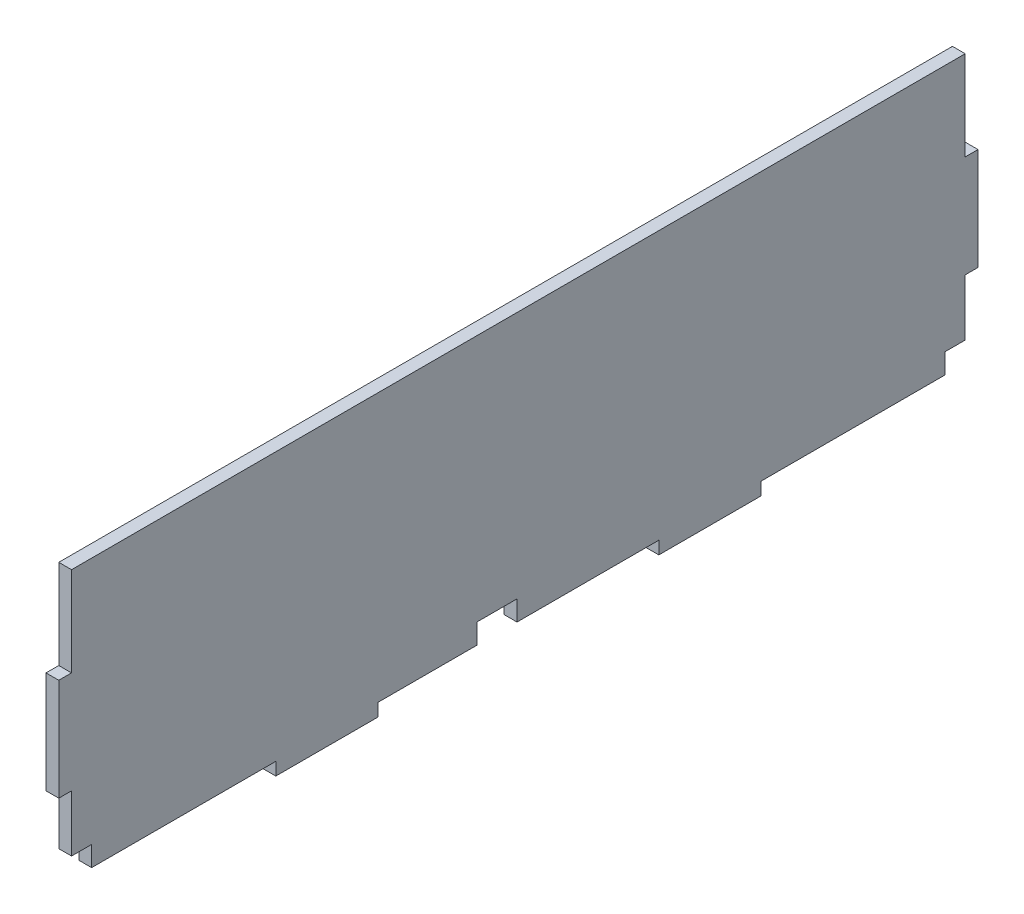
ISO-10303-21;
HEADER;
FILE_DESCRIPTION(('STEP AP214'),'2;1');
FILE_NAME('part.step','',(''),(''),'','','');
FILE_SCHEMA(('AUTOMOTIVE_DESIGN { 1 0 10303 214 1 1 1 1 }'));
ENDSEC;
DATA;
#1=APPLICATION_CONTEXT('core data for automotive mechanical design processes');
#2=APPLICATION_PROTOCOL_DEFINITION('international standard','automotive_design',2000,#1);
#3=PRODUCT_CONTEXT('',#1,'mechanical');
#4=PRODUCT('Part','Part','',(#3));
#5=PRODUCT_RELATED_PRODUCT_CATEGORY('part','',(#4));
#6=PRODUCT_DEFINITION_FORMATION('','',#4);
#7=PRODUCT_DEFINITION_CONTEXT('part definition',#1,'design');
#8=PRODUCT_DEFINITION('design','',#6,#7);
#9=PRODUCT_DEFINITION_SHAPE('','',#8);
#10=(LENGTH_UNIT() NAMED_UNIT(*) SI_UNIT(.MILLI.,.METRE.));
#11=(NAMED_UNIT(*) PLANE_ANGLE_UNIT() SI_UNIT($,.RADIAN.));
#12=(NAMED_UNIT(*) SI_UNIT($,.STERADIAN.) SOLID_ANGLE_UNIT());
#13=UNCERTAINTY_MEASURE_WITH_UNIT(LENGTH_MEASURE(1.E-05),#10,'distance_accuracy_value','');
#14=(GEOMETRIC_REPRESENTATION_CONTEXT(3) GLOBAL_UNCERTAINTY_ASSIGNED_CONTEXT((#13)) GLOBAL_UNIT_ASSIGNED_CONTEXT((#10,
#11,#12)) REPRESENTATION_CONTEXT('',''));
#15=CARTESIAN_POINT('',(0.,0.,0.));
#16=DIRECTION('',(0.,0.,1.));
#17=DIRECTION('',(1.,0.,0.));
#18=AXIS2_PLACEMENT_3D('',#15,#16,#17);
#19=CARTESIAN_POINT('',(3.175,-36.0159875393909,29.5840964815032));
#20=DIRECTION('',(0.,1.,0.));
#21=DIRECTION('',(0.,0.,1.));
#22=AXIS2_PLACEMENT_3D('',#19,#20,#21);
#23=PLANE('',#22);
#24=DIRECTION('',(0.,0.,-1.));
#25=VECTOR('',#24,1.);
#26=CARTESIAN_POINT('',(0.,-36.0159875393909,29.5840964815032));
#27=LINE('',#26,#25);
#28=CARTESIAN_POINT('',(0.,-36.0159875393909,29.5840964815032));
#29=VERTEX_POINT('',#28);
#30=CARTESIAN_POINT('',(0.,-36.0159875393909,5.));
#31=VERTEX_POINT('',#30);
#32=EDGE_CURVE('E235',#29,#31,#27,.T.);
#33=ORIENTED_EDGE('',*,*,#32,.T.);
#34=DIRECTION('',(1.,0.,0.));
#35=VECTOR('',#34,1.);
#36=CARTESIAN_POINT('',(-6.825,-36.0159875393909,5.));
#37=LINE('',#36,#35);
#38=CARTESIAN_POINT('',(3.175,-36.0159875393909,5.));
#39=VERTEX_POINT('',#38);
#40=EDGE_CURVE('E219',#31,#39,#37,.T.);
#41=ORIENTED_EDGE('',*,*,#40,.T.);
#42=DIRECTION('',(0.,0.,-1.));
#43=VECTOR('',#42,1.);
#44=CARTESIAN_POINT('',(3.175,-36.0159875393909,29.5840964815032));
#45=LINE('',#44,#43);
#46=CARTESIAN_POINT('',(3.175,-36.0159875393909,29.5840964815032));
#47=VERTEX_POINT('',#46);
#48=EDGE_CURVE('E233',#47,#39,#45,.T.);
#49=ORIENTED_EDGE('',*,*,#48,.F.);
#50=DIRECTION('',(-1.,0.,0.));
#51=VECTOR('',#50,1.);
#52=CARTESIAN_POINT('',(3.175,-36.0159875393909,29.5840964815032));
#53=LINE('',#52,#51);
#54=EDGE_CURVE('E335',#47,#29,#53,.T.);
#55=ORIENTED_EDGE('',*,*,#54,.T.);
#56=EDGE_LOOP('',(#33,#41,#49,#55));
#57=FACE_BOUND('',#56,.T.);
#58=ADVANCED_FACE('F33',(#57),#23,.F.);
#59=CARTESIAN_POINT('',(3.175,33.8340124606091,105.784096481503));
#60=DIRECTION('',(0.,0.,-1.));
#61=DIRECTION('',(0.,1.,0.));
#62=AXIS2_PLACEMENT_3D('',#59,#60,#61);
#63=PLANE('',#62);
#64=DIRECTION('',(0.,-1.,0.));
#65=VECTOR('',#64,1.);
#66=CARTESIAN_POINT('',(3.175,33.8340124606091,105.784096481503));
#67=LINE('',#66,#65);
#68=CARTESIAN_POINT('',(3.175,30.6590124606091,105.784096481503));
#69=VERTEX_POINT('',#68);
#70=CARTESIAN_POINT('',(3.175,8.43401246060913,105.784096481503));
#71=VERTEX_POINT('',#70);
#72=EDGE_CURVE('E311',#69,#71,#67,.T.);
#73=ORIENTED_EDGE('',*,*,#72,.F.);
#74=DIRECTION('',(1.,0.,0.));
#75=VECTOR('',#74,1.);
#76=CARTESIAN_POINT('',(0.,30.6590124606091,105.784096481503));
#77=LINE('',#76,#75);
#78=CARTESIAN_POINT('',(0.,30.6590124606091,105.784096481503));
#79=VERTEX_POINT('',#78);
#80=EDGE_CURVE('E413',#79,#69,#77,.T.);
#81=ORIENTED_EDGE('',*,*,#80,.F.);
#82=DIRECTION('',(0.,-1.,0.));
#83=VECTOR('',#82,1.);
#84=CARTESIAN_POINT('',(0.,33.8340124606091,105.784096481503));
#85=LINE('',#84,#83);
#86=CARTESIAN_POINT('',(0.,8.43401246060913,105.784096481503));
#87=VERTEX_POINT('',#86);
#88=EDGE_CURVE('E269',#79,#87,#85,.T.);
#89=ORIENTED_EDGE('',*,*,#88,.T.);
#90=DIRECTION('',(-1.,0.,0.));
#91=VECTOR('',#90,1.);
#92=CARTESIAN_POINT('',(3.175,8.43401246060913,105.784096481503));
#93=LINE('',#92,#91);
#94=EDGE_CURVE('E355',#71,#87,#93,.T.);
#95=ORIENTED_EDGE('',*,*,#94,.F.);
#96=EDGE_LOOP('',(#73,#81,#89,#95));
#97=FACE_BOUND('',#96,.T.);
#98=ADVANCED_FACE('F35',(#97),#63,.F.);
#99=CARTESIAN_POINT('',(3.175,8.43401246060913,105.784096481503));
#100=DIRECTION('',(0.,-1.,0.));
#101=DIRECTION('',(0.,0.,-1.));
#102=AXIS2_PLACEMENT_3D('',#99,#100,#101);
#103=PLANE('',#102);
#104=DIRECTION('',(0.,0.,1.));
#105=VECTOR('',#104,1.);
#106=CARTESIAN_POINT('',(0.,8.43401246060913,105.784096481503));
#107=LINE('',#106,#105);
#108=CARTESIAN_POINT('',(0.,8.43401246060913,108.959096481503));
#109=VERTEX_POINT('',#108);
#110=EDGE_CURVE('E271',#87,#109,#107,.T.);
#111=ORIENTED_EDGE('',*,*,#110,.T.);
#112=DIRECTION('',(-1.,0.,0.));
#113=VECTOR('',#112,1.);
#114=CARTESIAN_POINT('',(3.175,8.43401246060913,108.959096481503));
#115=LINE('',#114,#113);
#116=CARTESIAN_POINT('',(3.175,8.43401246060913,108.959096481503));
#117=VERTEX_POINT('',#116);
#118=EDGE_CURVE('E352',#117,#109,#115,.T.);
#119=ORIENTED_EDGE('',*,*,#118,.F.);
#120=DIRECTION('',(0.,0.,1.));
#121=VECTOR('',#120,1.);
#122=CARTESIAN_POINT('',(3.175,8.43401246060913,105.784096481503));
#123=LINE('',#122,#121);
#124=EDGE_CURVE('E419',#71,#117,#123,.T.);
#125=ORIENTED_EDGE('',*,*,#124,.F.);
#126=ORIENTED_EDGE('',*,*,#94,.T.);
#127=EDGE_LOOP('',(#111,#119,#125,#126));
#128=FACE_BOUND('',#127,.T.);
#129=ADVANCED_FACE('F477',(#128),#103,.F.);
#130=CARTESIAN_POINT('',(3.175,8.43401246060913,108.959096481503));
#131=DIRECTION('',(0.,0.,-1.));
#132=DIRECTION('',(-1.,0.,0.));
#133=AXIS2_PLACEMENT_3D('',#130,#131,#132);
#134=PLANE('',#133);
#135=DIRECTION('',(0.,-1.,0.));
#136=VECTOR('',#135,1.);
#137=CARTESIAN_POINT('',(0.,8.43401246060913,108.959096481503));
#138=LINE('',#137,#136);
#139=CARTESIAN_POINT('',(0.,-16.9659875393909,108.959096481503));
#140=VERTEX_POINT('',#139);
#141=EDGE_CURVE('E274',#109,#140,#138,.T.);
#142=ORIENTED_EDGE('',*,*,#141,.T.);
#143=DIRECTION('',(-1.,0.,0.));
#144=VECTOR('',#143,1.);
#145=CARTESIAN_POINT('',(3.175,-16.9659875393909,108.959096481503));
#146=LINE('',#145,#144);
#147=CARTESIAN_POINT('',(3.175,-16.9659875393909,108.959096481503));
#148=VERTEX_POINT('',#147);
#149=EDGE_CURVE('E349',#148,#140,#146,.T.);
#150=ORIENTED_EDGE('',*,*,#149,.F.);
#151=DIRECTION('',(0.,-1.,0.));
#152=VECTOR('',#151,1.);
#153=CARTESIAN_POINT('',(3.175,8.43401246060913,108.959096481503));
#154=LINE('',#153,#152);
#155=EDGE_CURVE('E421',#117,#148,#154,.T.);
#156=ORIENTED_EDGE('',*,*,#155,.F.);
#157=ORIENTED_EDGE('',*,*,#118,.T.);
#158=EDGE_LOOP('',(#142,#150,#156,#157));
#159=FACE_BOUND('',#158,.T.);
#160=ADVANCED_FACE('F473',(#159),#134,.F.);
#161=CARTESIAN_POINT('',(3.175,-16.9659875393909,108.959096481503));
#162=DIRECTION('',(0.,1.,0.));
#163=DIRECTION('',(0.,0.,1.));
#164=AXIS2_PLACEMENT_3D('',#161,#162,#163);
#165=PLANE('',#164);
#166=DIRECTION('',(0.,0.,-1.));
#167=VECTOR('',#166,1.);
#168=CARTESIAN_POINT('',(0.,-16.9659875393909,108.959096481503));
#169=LINE('',#168,#167);
#170=CARTESIAN_POINT('',(0.,-16.9659875393909,105.784096481503));
#171=VERTEX_POINT('',#170);
#172=EDGE_CURVE('E276',#140,#171,#169,.T.);
#173=ORIENTED_EDGE('',*,*,#172,.T.);
#174=DIRECTION('',(-1.,0.,0.));
#175=VECTOR('',#174,1.);
#176=CARTESIAN_POINT('',(3.175,-16.9659875393909,105.784096481503));
#177=LINE('',#176,#175);
#178=CARTESIAN_POINT('',(3.175,-16.9659875393909,105.784096481503));
#179=VERTEX_POINT('',#178);
#180=EDGE_CURVE('E346',#179,#171,#177,.T.);
#181=ORIENTED_EDGE('',*,*,#180,.F.);
#182=DIRECTION('',(0.,0.,-1.));
#183=VECTOR('',#182,1.);
#184=CARTESIAN_POINT('',(3.175,-16.9659875393909,108.959096481503));
#185=LINE('',#184,#183);
#186=EDGE_CURVE('E423',#148,#179,#185,.T.);
#187=ORIENTED_EDGE('',*,*,#186,.F.);
#188=ORIENTED_EDGE('',*,*,#149,.T.);
#189=EDGE_LOOP('',(#173,#181,#187,#188));
#190=FACE_BOUND('',#189,.T.);
#191=ADVANCED_FACE('F468',(#190),#165,.F.);
#192=CARTESIAN_POINT('',(3.175,-16.9659875393909,105.784096481503));
#193=DIRECTION('',(0.,0.,-1.));
#194=DIRECTION('',(0.,1.,0.));
#195=AXIS2_PLACEMENT_3D('',#192,#193,#194);
#196=PLANE('',#195);
#197=DIRECTION('',(0.,-1.,0.));
#198=VECTOR('',#197,1.);
#199=CARTESIAN_POINT('',(0.,-16.9659875393909,105.784096481503));
#200=LINE('',#199,#198);
#201=CARTESIAN_POINT('',(0.,-31.0159875393909,105.784096481503));
#202=VERTEX_POINT('',#201);
#203=EDGE_CURVE('E278',#171,#202,#200,.T.);
#204=ORIENTED_EDGE('',*,*,#203,.T.);
#205=DIRECTION('',(1.,0.,0.));
#206=VECTOR('',#205,1.);
#207=CARTESIAN_POINT('',(-6.825,-31.0159875393909,105.784096481503));
#208=LINE('',#207,#206);
#209=CARTESIAN_POINT('',(3.175,-31.0159875393909,105.784096481503));
#210=VERTEX_POINT('',#209);
#211=EDGE_CURVE('E403',#202,#210,#208,.T.);
#212=ORIENTED_EDGE('',*,*,#211,.T.);
#213=DIRECTION('',(0.,-1.,0.));
#214=VECTOR('',#213,1.);
#215=CARTESIAN_POINT('',(3.175,-16.9659875393909,105.784096481503));
#216=LINE('',#215,#214);
#217=EDGE_CURVE('E425',#179,#210,#216,.T.);
#218=ORIENTED_EDGE('',*,*,#217,.F.);
#219=ORIENTED_EDGE('',*,*,#180,.T.);
#220=EDGE_LOOP('',(#204,#212,#218,#219));
#221=FACE_BOUND('',#220,.T.);
#222=ADVANCED_FACE('F461',(#221),#196,.F.);
#223=CARTESIAN_POINT('',(3.175,-36.0159875393909,105.784096481503));
#224=DIRECTION('',(0.,1.,0.));
#225=DIRECTION('',(0.,0.,1.));
#226=AXIS2_PLACEMENT_3D('',#223,#224,#225);
#227=PLANE('',#226);
#228=DIRECTION('',(0.,0.,-1.));
#229=VECTOR('',#228,1.);
#230=CARTESIAN_POINT('',(3.175,-36.0159875393909,105.784096481503));
#231=LINE('',#230,#229);
#232=CARTESIAN_POINT('',(3.175,-36.0159875393909,100.784096481503));
#233=VERTEX_POINT('',#232);
#234=CARTESIAN_POINT('',(3.175,-36.0159875393909,54.9840964815032));
#235=VERTEX_POINT('',#234);
#236=EDGE_CURVE('E428',#233,#235,#231,.T.);
#237=ORIENTED_EDGE('',*,*,#236,.F.);
#238=DIRECTION('',(1.,0.,0.));
#239=VECTOR('',#238,1.);
#240=CARTESIAN_POINT('',(-6.825,-36.0159875393909,100.784096481503));
#241=LINE('',#240,#239);
#242=CARTESIAN_POINT('',(0.,-36.0159875393909,100.784096481503));
#243=VERTEX_POINT('',#242);
#244=EDGE_CURVE('E402',#243,#233,#241,.T.);
#245=ORIENTED_EDGE('',*,*,#244,.F.);
#246=DIRECTION('',(0.,0.,-1.));
#247=VECTOR('',#246,1.);
#248=CARTESIAN_POINT('',(0.,-36.0159875393909,105.784096481503));
#249=LINE('',#248,#247);
#250=CARTESIAN_POINT('',(0.,-36.0159875393909,54.9840964815032));
#251=VERTEX_POINT('',#250);
#252=EDGE_CURVE('E281',#243,#251,#249,.T.);
#253=ORIENTED_EDGE('',*,*,#252,.T.);
#254=DIRECTION('',(-1.,0.,0.));
#255=VECTOR('',#254,1.);
#256=CARTESIAN_POINT('',(3.175,-36.0159875393909,54.9840964815032));
#257=LINE('',#256,#255);
#258=EDGE_CURVE('E343',#235,#251,#257,.T.);
#259=ORIENTED_EDGE('',*,*,#258,.F.);
#260=EDGE_LOOP('',(#237,#245,#253,#259));
#261=FACE_BOUND('',#260,.T.);
#262=ADVANCED_FACE('F450',(#261),#227,.F.);
#263=CARTESIAN_POINT('',(3.175,-36.0159875393909,54.9840964815032));
#264=DIRECTION('',(0.,0.,-1.));
#265=DIRECTION('',(0.,1.,0.));
#266=AXIS2_PLACEMENT_3D('',#263,#264,#265);
#267=PLANE('',#266);
#268=DIRECTION('',(0.,-1.,0.));
#269=VECTOR('',#268,1.);
#270=CARTESIAN_POINT('',(0.,-36.0159875393909,54.9840964815032));
#271=LINE('',#270,#269);
#272=CARTESIAN_POINT('',(0.,-39.1909875393909,54.9840964815032));
#273=VERTEX_POINT('',#272);
#274=EDGE_CURVE('E283',#251,#273,#271,.T.);
#275=ORIENTED_EDGE('',*,*,#274,.T.);
#276=DIRECTION('',(-1.,0.,0.));
#277=VECTOR('',#276,1.);
#278=CARTESIAN_POINT('',(3.175,-39.1909875393909,54.9840964815032));
#279=LINE('',#278,#277);
#280=CARTESIAN_POINT('',(3.175,-39.1909875393909,54.9840964815032));
#281=VERTEX_POINT('',#280);
#282=EDGE_CURVE('E340',#281,#273,#279,.T.);
#283=ORIENTED_EDGE('',*,*,#282,.F.);
#284=DIRECTION('',(0.,-1.,0.));
#285=VECTOR('',#284,1.);
#286=CARTESIAN_POINT('',(3.175,-36.0159875393909,54.9840964815032));
#287=LINE('',#286,#285);
#288=EDGE_CURVE('E430',#235,#281,#287,.T.);
#289=ORIENTED_EDGE('',*,*,#288,.F.);
#290=ORIENTED_EDGE('',*,*,#258,.T.);
#291=EDGE_LOOP('',(#275,#283,#289,#290));
#292=FACE_BOUND('',#291,.T.);
#293=ADVANCED_FACE('F446',(#292),#267,.F.);
#294=CARTESIAN_POINT('',(3.175,-39.1909875393909,54.9840964815032));
#295=DIRECTION('',(0.,1.,0.));
#296=DIRECTION('',(0.,0.,1.));
#297=AXIS2_PLACEMENT_3D('',#294,#295,#296);
#298=PLANE('',#297);
#299=DIRECTION('',(0.,0.,-1.));
#300=VECTOR('',#299,1.);
#301=CARTESIAN_POINT('',(0.,-39.1909875393909,54.9840964815032));
#302=LINE('',#301,#300);
#303=CARTESIAN_POINT('',(0.,-39.1909875393909,29.5840964815032));
#304=VERTEX_POINT('',#303);
#305=EDGE_CURVE('E285',#273,#304,#302,.T.);
#306=ORIENTED_EDGE('',*,*,#305,.T.);
#307=DIRECTION('',(-1.,0.,0.));
#308=VECTOR('',#307,1.);
#309=CARTESIAN_POINT('',(3.175,-39.1909875393909,29.5840964815032));
#310=LINE('',#309,#308);
#311=CARTESIAN_POINT('',(3.175,-39.1909875393909,29.5840964815032));
#312=VERTEX_POINT('',#311);
#313=EDGE_CURVE('E337',#312,#304,#310,.T.);
#314=ORIENTED_EDGE('',*,*,#313,.F.);
#315=DIRECTION('',(0.,0.,-1.));
#316=VECTOR('',#315,1.);
#317=CARTESIAN_POINT('',(3.175,-39.1909875393909,54.9840964815032));
#318=LINE('',#317,#316);
#319=EDGE_CURVE('E431',#281,#312,#318,.T.);
#320=ORIENTED_EDGE('',*,*,#319,.F.);
#321=ORIENTED_EDGE('',*,*,#282,.T.);
#322=EDGE_LOOP('',(#306,#314,#320,#321));
#323=FACE_BOUND('',#322,.T.);
#324=ADVANCED_FACE('F437',(#323),#298,.F.);
#325=CARTESIAN_POINT('',(3.175,-39.1909875393909,29.5840964815032));
#326=DIRECTION('',(0.,0.,1.));
#327=DIRECTION('',(0.,-1.,0.));
#328=AXIS2_PLACEMENT_3D('',#325,#326,#327);
#329=PLANE('',#328);
#330=DIRECTION('',(0.,1.,0.));
#331=VECTOR('',#330,1.);
#332=CARTESIAN_POINT('',(0.,-39.1909875393909,29.5840964815032));
#333=LINE('',#332,#331);
#334=EDGE_CURVE('E287',#304,#29,#333,.T.);
#335=ORIENTED_EDGE('',*,*,#334,.T.);
#336=ORIENTED_EDGE('',*,*,#54,.F.);
#337=DIRECTION('',(0.,1.,0.));
#338=VECTOR('',#337,1.);
#339=CARTESIAN_POINT('',(3.175,-39.1909875393909,29.5840964815032));
#340=LINE('',#339,#338);
#341=EDGE_CURVE('E241',#312,#47,#340,.T.);
#342=ORIENTED_EDGE('',*,*,#341,.F.);
#343=ORIENTED_EDGE('',*,*,#313,.T.);
#344=EDGE_LOOP('',(#335,#336,#342,#343));
#345=FACE_BOUND('',#344,.T.);
#346=ADVANCED_FACE('F441',(#345),#329,.F.);
#347=CARTESIAN_POINT('',(3.175,-36.0159875393909,-5.));
#348=VERTEX_POINT('',#347);
#349=CARTESIAN_POINT('',(3.175,-36.0159875393908,-40.2659035184968));
#350=VERTEX_POINT('',#349);
#351=EDGE_CURVE('E244',#348,#350,#45,.T.);
#352=ORIENTED_EDGE('',*,*,#351,.F.);
#353=DIRECTION('',(1.,0.,0.));
#354=VECTOR('',#353,1.);
#355=CARTESIAN_POINT('',(-6.825,-36.0159875393909,-5.));
#356=LINE('',#355,#354);
#357=CARTESIAN_POINT('',(0.,-36.0159875393909,-5.));
#358=VERTEX_POINT('',#357);
#359=EDGE_CURVE('E236',#358,#348,#356,.T.);
#360=ORIENTED_EDGE('',*,*,#359,.F.);
#361=CARTESIAN_POINT('',(0.,-36.0159875393908,-40.2659035184968));
#362=VERTEX_POINT('',#361);
#363=EDGE_CURVE('E289',#358,#362,#27,.T.);
#364=ORIENTED_EDGE('',*,*,#363,.T.);
#365=DIRECTION('',(-1.,0.,0.));
#366=VECTOR('',#365,1.);
#367=CARTESIAN_POINT('',(3.175,-36.0159875393908,-40.2659035184968));
#368=LINE('',#367,#366);
#369=EDGE_CURVE('E332',#350,#362,#368,.T.);
#370=ORIENTED_EDGE('',*,*,#369,.F.);
#371=EDGE_LOOP('',(#352,#360,#364,#370));
#372=FACE_BOUND('',#371,.T.);
#373=ADVANCED_FACE('F381',(#372),#23,.F.);
#374=CARTESIAN_POINT('',(3.175,-36.0159875393908,-40.2659035184968));
#375=DIRECTION('',(0.,0.,-1.));
#376=DIRECTION('',(0.,1.,0.));
#377=AXIS2_PLACEMENT_3D('',#374,#375,#376);
#378=PLANE('',#377);
#379=DIRECTION('',(0.,-1.,0.));
#380=VECTOR('',#379,1.);
#381=CARTESIAN_POINT('',(0.,-36.0159875393908,-40.2659035184968));
#382=LINE('',#381,#380);
#383=CARTESIAN_POINT('',(0.,-39.1909875393909,-40.2659035184968));
#384=VERTEX_POINT('',#383);
#385=EDGE_CURVE('E291',#362,#384,#382,.T.);
#386=ORIENTED_EDGE('',*,*,#385,.T.);
#387=DIRECTION('',(-1.,0.,0.));
#388=VECTOR('',#387,1.);
#389=CARTESIAN_POINT('',(3.175,-39.1909875393909,-40.2659035184968));
#390=LINE('',#389,#388);
#391=CARTESIAN_POINT('',(3.175,-39.1909875393909,-40.2659035184968));
#392=VERTEX_POINT('',#391);
#393=EDGE_CURVE('E329',#392,#384,#390,.T.);
#394=ORIENTED_EDGE('',*,*,#393,.F.);
#395=DIRECTION('',(0.,-1.,0.));
#396=VECTOR('',#395,1.);
#397=CARTESIAN_POINT('',(3.175,-36.0159875393908,-40.2659035184968));
#398=LINE('',#397,#396);
#399=EDGE_CURVE('E243',#350,#392,#398,.T.);
#400=ORIENTED_EDGE('',*,*,#399,.F.);
#401=ORIENTED_EDGE('',*,*,#369,.T.);
#402=EDGE_LOOP('',(#386,#394,#400,#401));
#403=FACE_BOUND('',#402,.T.);
#404=ADVANCED_FACE('F535',(#403),#378,.F.);
#405=CARTESIAN_POINT('',(3.175,-39.1909875393909,-40.2659035184968));
#406=DIRECTION('',(0.,1.,0.));
#407=DIRECTION('',(0.,0.,1.));
#408=AXIS2_PLACEMENT_3D('',#405,#406,#407);
#409=PLANE('',#408);
#410=DIRECTION('',(0.,0.,-1.));
#411=VECTOR('',#410,1.);
#412=CARTESIAN_POINT('',(0.,-39.1909875393909,-40.2659035184968));
#413=LINE('',#412,#411);
#414=CARTESIAN_POINT('',(0.,-39.1909875393909,-65.6659035184968));
#415=VERTEX_POINT('',#414);
#416=EDGE_CURVE('E293',#384,#415,#413,.T.);
#417=ORIENTED_EDGE('',*,*,#416,.T.);
#418=DIRECTION('',(-1.,0.,0.));
#419=VECTOR('',#418,1.);
#420=CARTESIAN_POINT('',(3.175,-39.1909875393909,-65.6659035184968));
#421=LINE('',#420,#419);
#422=CARTESIAN_POINT('',(3.175,-39.1909875393909,-65.6659035184968));
#423=VERTEX_POINT('',#422);
#424=EDGE_CURVE('E326',#423,#415,#421,.T.);
#425=ORIENTED_EDGE('',*,*,#424,.F.);
#426=DIRECTION('',(0.,0.,-1.));
#427=VECTOR('',#426,1.);
#428=CARTESIAN_POINT('',(3.175,-39.1909875393909,-40.2659035184968));
#429=LINE('',#428,#427);
#430=EDGE_CURVE('E246',#392,#423,#429,.T.);
#431=ORIENTED_EDGE('',*,*,#430,.F.);
#432=ORIENTED_EDGE('',*,*,#393,.T.);
#433=EDGE_LOOP('',(#417,#425,#431,#432));
#434=FACE_BOUND('',#433,.T.);
#435=ADVANCED_FACE('F531',(#434),#409,.F.);
#436=CARTESIAN_POINT('',(3.175,-39.1909875393909,-65.6659035184968));
#437=DIRECTION('',(0.,0.,1.));
#438=DIRECTION('',(1.,0.,0.));
#439=AXIS2_PLACEMENT_3D('',#436,#437,#438);
#440=PLANE('',#439);
#441=DIRECTION('',(0.,1.,0.));
#442=VECTOR('',#441,1.);
#443=CARTESIAN_POINT('',(0.,-39.1909875393909,-65.6659035184968));
#444=LINE('',#443,#442);
#445=CARTESIAN_POINT('',(0.,-36.0159875393908,-65.6659035184968));
#446=VERTEX_POINT('',#445);
#447=EDGE_CURVE('E295',#415,#446,#444,.T.);
#448=ORIENTED_EDGE('',*,*,#447,.T.);
#449=DIRECTION('',(-1.,0.,0.));
#450=VECTOR('',#449,1.);
#451=CARTESIAN_POINT('',(3.175,-36.0159875393908,-65.6659035184968));
#452=LINE('',#451,#450);
#453=CARTESIAN_POINT('',(3.175,-36.0159875393908,-65.6659035184968));
#454=VERTEX_POINT('',#453);
#455=EDGE_CURVE('E323',#454,#446,#452,.T.);
#456=ORIENTED_EDGE('',*,*,#455,.F.);
#457=DIRECTION('',(0.,1.,0.));
#458=VECTOR('',#457,1.);
#459=CARTESIAN_POINT('',(3.175,-39.1909875393909,-65.6659035184968));
#460=LINE('',#459,#458);
#461=EDGE_CURVE('E252',#423,#454,#460,.T.);
#462=ORIENTED_EDGE('',*,*,#461,.F.);
#463=ORIENTED_EDGE('',*,*,#424,.T.);
#464=EDGE_LOOP('',(#448,#456,#462,#463));
#465=FACE_BOUND('',#464,.T.);
#466=ADVANCED_FACE('F526',(#465),#440,.F.);
#467=CARTESIAN_POINT('',(3.175,-36.0159875393908,-65.6659035184968));
#468=DIRECTION('',(0.,1.,0.));
#469=DIRECTION('',(0.,0.,1.));
#470=AXIS2_PLACEMENT_3D('',#467,#468,#469);
#471=PLANE('',#470);
#472=DIRECTION('',(0.,0.,-1.));
#473=VECTOR('',#472,1.);
#474=CARTESIAN_POINT('',(0.,-36.0159875393908,-65.6659035184968));
#475=LINE('',#474,#473);
#476=CARTESIAN_POINT('',(0.,-36.0159875393908,-111.465903518497));
#477=VERTEX_POINT('',#476);
#478=EDGE_CURVE('E297',#446,#477,#475,.T.);
#479=ORIENTED_EDGE('',*,*,#478,.T.);
#480=DIRECTION('',(1.,0.,0.));
#481=VECTOR('',#480,1.);
#482=CARTESIAN_POINT('',(-6.825,-36.0159875393908,-111.465903518497));
#483=LINE('',#482,#481);
#484=CARTESIAN_POINT('',(3.175,-36.0159875393908,-111.465903518497));
#485=VERTEX_POINT('',#484);
#486=EDGE_CURVE('E392',#477,#485,#483,.T.);
#487=ORIENTED_EDGE('',*,*,#486,.T.);
#488=DIRECTION('',(0.,0.,-1.));
#489=VECTOR('',#488,1.);
#490=CARTESIAN_POINT('',(3.175,-36.0159875393908,-65.6659035184968));
#491=LINE('',#490,#489);
#492=EDGE_CURVE('E254',#454,#485,#491,.T.);
#493=ORIENTED_EDGE('',*,*,#492,.F.);
#494=ORIENTED_EDGE('',*,*,#455,.T.);
#495=EDGE_LOOP('',(#479,#487,#493,#494));
#496=FACE_BOUND('',#495,.T.);
#497=ADVANCED_FACE('F520',(#496),#471,.F.);
#498=CARTESIAN_POINT('',(3.175,-16.9659875393908,-116.465903518497));
#499=DIRECTION('',(0.,0.,1.));
#500=DIRECTION('',(0.,-1.,0.));
#501=AXIS2_PLACEMENT_3D('',#498,#499,#500);
#502=PLANE('',#501);
#503=DIRECTION('',(0.,1.,0.));
#504=VECTOR('',#503,1.);
#505=CARTESIAN_POINT('',(3.175,-16.9659875393908,-116.465903518497));
#506=LINE('',#505,#504);
#507=CARTESIAN_POINT('',(3.175,-31.0159875393909,-116.465903518497));
#508=VERTEX_POINT('',#507);
#509=CARTESIAN_POINT('',(3.175,-16.9659875393908,-116.465903518497));
#510=VERTEX_POINT('',#509);
#511=EDGE_CURVE('E257',#508,#510,#506,.T.);
#512=ORIENTED_EDGE('',*,*,#511,.F.);
#513=DIRECTION('',(1.,0.,0.));
#514=VECTOR('',#513,1.);
#515=CARTESIAN_POINT('',(-6.825,-31.0159875393909,-116.465903518497));
#516=LINE('',#515,#514);
#517=CARTESIAN_POINT('',(0.,-31.0159875393909,-116.465903518497));
#518=VERTEX_POINT('',#517);
#519=EDGE_CURVE('E391',#518,#508,#516,.T.);
#520=ORIENTED_EDGE('',*,*,#519,.F.);
#521=DIRECTION('',(0.,1.,0.));
#522=VECTOR('',#521,1.);
#523=CARTESIAN_POINT('',(0.,-16.9659875393908,-116.465903518497));
#524=LINE('',#523,#522);
#525=CARTESIAN_POINT('',(0.,-16.9659875393908,-116.465903518497));
#526=VERTEX_POINT('',#525);
#527=EDGE_CURVE('E300',#518,#526,#524,.T.);
#528=ORIENTED_EDGE('',*,*,#527,.T.);
#529=DIRECTION('',(-1.,0.,0.));
#530=VECTOR('',#529,1.);
#531=CARTESIAN_POINT('',(3.175,-16.9659875393908,-116.465903518497));
#532=LINE('',#531,#530);
#533=EDGE_CURVE('E320',#510,#526,#532,.T.);
#534=ORIENTED_EDGE('',*,*,#533,.F.);
#535=EDGE_LOOP('',(#512,#520,#528,#534));
#536=FACE_BOUND('',#535,.T.);
#537=ADVANCED_FACE('F512',(#536),#502,.F.);
#538=CARTESIAN_POINT('',(3.175,-16.9659875393909,-119.640903518497));
#539=DIRECTION('',(0.,1.,0.));
#540=DIRECTION('',(0.,0.,1.));
#541=AXIS2_PLACEMENT_3D('',#538,#539,#540);
#542=PLANE('',#541);
#543=DIRECTION('',(0.,0.,-1.));
#544=VECTOR('',#543,1.);
#545=CARTESIAN_POINT('',(0.,-16.9659875393909,-119.640903518497));
#546=LINE('',#545,#544);
#547=CARTESIAN_POINT('',(0.,-16.9659875393909,-119.640903518497));
#548=VERTEX_POINT('',#547);
#549=EDGE_CURVE('E302',#526,#548,#546,.T.);
#550=ORIENTED_EDGE('',*,*,#549,.T.);
#551=DIRECTION('',(-1.,0.,0.));
#552=VECTOR('',#551,1.);
#553=CARTESIAN_POINT('',(3.175,-16.9659875393909,-119.640903518497));
#554=LINE('',#553,#552);
#555=CARTESIAN_POINT('',(3.175,-16.9659875393909,-119.640903518497));
#556=VERTEX_POINT('',#555);
#557=EDGE_CURVE('E317',#556,#548,#554,.T.);
#558=ORIENTED_EDGE('',*,*,#557,.F.);
#559=DIRECTION('',(0.,0.,-1.));
#560=VECTOR('',#559,1.);
#561=CARTESIAN_POINT('',(3.175,-16.9659875393909,-119.640903518497));
#562=LINE('',#561,#560);
#563=EDGE_CURVE('E259',#510,#556,#562,.T.);
#564=ORIENTED_EDGE('',*,*,#563,.F.);
#565=ORIENTED_EDGE('',*,*,#533,.T.);
#566=EDGE_LOOP('',(#550,#558,#564,#565));
#567=FACE_BOUND('',#566,.T.);
#568=ADVANCED_FACE('F504',(#567),#542,.F.);
#569=CARTESIAN_POINT('',(3.175,8.43401246060915,-119.640903518497));
#570=DIRECTION('',(0.,0.,1.));
#571=DIRECTION('',(0.,-1.,0.));
#572=AXIS2_PLACEMENT_3D('',#569,#570,#571);
#573=PLANE('',#572);
#574=DIRECTION('',(0.,1.,0.));
#575=VECTOR('',#574,1.);
#576=CARTESIAN_POINT('',(0.,8.43401246060915,-119.640903518497));
#577=LINE('',#576,#575);
#578=CARTESIAN_POINT('',(0.,8.43401246060915,-119.640903518497));
#579=VERTEX_POINT('',#578);
#580=EDGE_CURVE('E304',#548,#579,#577,.T.);
#581=ORIENTED_EDGE('',*,*,#580,.T.);
#582=DIRECTION('',(-1.,0.,0.));
#583=VECTOR('',#582,1.);
#584=CARTESIAN_POINT('',(3.175,8.43401246060915,-119.640903518497));
#585=LINE('',#584,#583);
#586=CARTESIAN_POINT('',(3.175,8.43401246060915,-119.640903518497));
#587=VERTEX_POINT('',#586);
#588=EDGE_CURVE('E314',#587,#579,#585,.T.);
#589=ORIENTED_EDGE('',*,*,#588,.F.);
#590=DIRECTION('',(0.,1.,0.));
#591=VECTOR('',#590,1.);
#592=CARTESIAN_POINT('',(3.175,8.43401246060915,-119.640903518497));
#593=LINE('',#592,#591);
#594=EDGE_CURVE('E261',#556,#587,#593,.T.);
#595=ORIENTED_EDGE('',*,*,#594,.F.);
#596=ORIENTED_EDGE('',*,*,#557,.T.);
#597=EDGE_LOOP('',(#581,#589,#595,#596));
#598=FACE_BOUND('',#597,.T.);
#599=ADVANCED_FACE('F500',(#598),#573,.F.);
#600=CARTESIAN_POINT('',(3.175,8.43401246060915,-116.465903518497));
#601=DIRECTION('',(0.,-1.,0.));
#602=DIRECTION('',(0.,0.,-1.));
#603=AXIS2_PLACEMENT_3D('',#600,#601,#602);
#604=PLANE('',#603);
#605=DIRECTION('',(0.,0.,1.));
#606=VECTOR('',#605,1.);
#607=CARTESIAN_POINT('',(0.,8.43401246060915,-116.465903518497));
#608=LINE('',#607,#606);
#609=CARTESIAN_POINT('',(0.,8.43401246060915,-116.465903518497));
#610=VERTEX_POINT('',#609);
#611=EDGE_CURVE('E306',#579,#610,#608,.T.);
#612=ORIENTED_EDGE('',*,*,#611,.T.);
#613=DIRECTION('',(-1.,0.,0.));
#614=VECTOR('',#613,1.);
#615=CARTESIAN_POINT('',(3.175,8.43401246060915,-116.465903518497));
#616=LINE('',#615,#614);
#617=CARTESIAN_POINT('',(3.175,8.43401246060915,-116.465903518497));
#618=VERTEX_POINT('',#617);
#619=EDGE_CURVE('E268',#618,#610,#616,.T.);
#620=ORIENTED_EDGE('',*,*,#619,.F.);
#621=DIRECTION('',(0.,0.,1.));
#622=VECTOR('',#621,1.);
#623=CARTESIAN_POINT('',(3.175,8.43401246060915,-116.465903518497));
#624=LINE('',#623,#622);
#625=EDGE_CURVE('E263',#587,#618,#624,.T.);
#626=ORIENTED_EDGE('',*,*,#625,.F.);
#627=ORIENTED_EDGE('',*,*,#588,.T.);
#628=EDGE_LOOP('',(#612,#620,#626,#627));
#629=FACE_BOUND('',#628,.T.);
#630=ADVANCED_FACE('F496',(#629),#604,.F.);
#631=CARTESIAN_POINT('',(3.175,33.8340124606091,-116.465903518496));
#632=DIRECTION('',(0.,0.,1.));
#633=DIRECTION('',(0.,-1.,0.));
#634=AXIS2_PLACEMENT_3D('',#631,#632,#633);
#635=PLANE('',#634);
#636=DIRECTION('',(0.,1.,0.));
#637=VECTOR('',#636,1.);
#638=CARTESIAN_POINT('',(0.,33.8340124606091,-116.465903518496));
#639=LINE('',#638,#637);
#640=CARTESIAN_POINT('',(0.,30.6590124606091,-116.465903518496));
#641=VERTEX_POINT('',#640);
#642=EDGE_CURVE('E308',#610,#641,#639,.T.);
#643=ORIENTED_EDGE('',*,*,#642,.T.);
#644=DIRECTION('',(1.,0.,0.));
#645=VECTOR('',#644,1.);
#646=CARTESIAN_POINT('',(0.,30.6590124606091,-116.465903518497));
#647=LINE('',#646,#645);
#648=CARTESIAN_POINT('',(3.175,30.6590124606091,-116.465903518497));
#649=VERTEX_POINT('',#648);
#650=EDGE_CURVE('E272',#641,#649,#647,.T.);
#651=ORIENTED_EDGE('',*,*,#650,.T.);
#652=DIRECTION('',(0.,1.,0.));
#653=VECTOR('',#652,1.);
#654=CARTESIAN_POINT('',(3.175,33.8340124606091,-116.465903518496));
#655=LINE('',#654,#653);
#656=EDGE_CURVE('E265',#618,#649,#655,.T.);
#657=ORIENTED_EDGE('',*,*,#656,.F.);
#658=ORIENTED_EDGE('',*,*,#619,.T.);
#659=EDGE_LOOP('',(#643,#651,#657,#658));
#660=FACE_BOUND('',#659,.T.);
#661=ADVANCED_FACE('F491',(#660),#635,.F.);
#662=CARTESIAN_POINT('',(3.175,0.,0.));
#663=DIRECTION('',(-1.,0.,0.));
#664=DIRECTION('',(0.,0.,1.));
#665=AXIS2_PLACEMENT_3D('',#662,#663,#664);
#666=PLANE('',#665);
#667=ORIENTED_EDGE('',*,*,#48,.T.);
#668=DIRECTION('',(0.,-1.,0.));
#669=VECTOR('',#668,1.);
#670=CARTESIAN_POINT('',(3.175,-31.0159875393909,5.));
#671=LINE('',#670,#669);
#672=CARTESIAN_POINT('',(3.175,-31.0159875393909,5.));
#673=VERTEX_POINT('',#672);
#674=EDGE_CURVE('E216',#673,#39,#671,.T.);
#675=ORIENTED_EDGE('',*,*,#674,.F.);
#676=DIRECTION('',(0.,0.,1.));
#677=VECTOR('',#676,1.);
#678=CARTESIAN_POINT('',(3.175,-31.0159875393909,5.));
#679=LINE('',#678,#677);
#680=CARTESIAN_POINT('',(3.175,-31.0159875393909,-5.));
#681=VERTEX_POINT('',#680);
#682=EDGE_CURVE('E237',#681,#673,#679,.T.);
#683=ORIENTED_EDGE('',*,*,#682,.F.);
#684=DIRECTION('',(0.,1.,0.));
#685=VECTOR('',#684,1.);
#686=CARTESIAN_POINT('',(3.175,-31.0159875393909,-5.));
#687=LINE('',#686,#685);
#688=EDGE_CURVE('E227',#348,#681,#687,.T.);
#689=ORIENTED_EDGE('',*,*,#688,.F.);
#690=ORIENTED_EDGE('',*,*,#351,.T.);
#691=ORIENTED_EDGE('',*,*,#399,.T.);
#692=ORIENTED_EDGE('',*,*,#430,.T.);
#693=ORIENTED_EDGE('',*,*,#461,.T.);
#694=ORIENTED_EDGE('',*,*,#492,.T.);
#695=DIRECTION('',(0.,-1.,0.));
#696=VECTOR('',#695,1.);
#697=CARTESIAN_POINT('',(3.175,-36.0159875393908,-111.465903518497));
#698=LINE('',#697,#696);
#699=CARTESIAN_POINT('',(3.175,-31.0159875393909,-111.465903518497));
#700=VERTEX_POINT('',#699);
#701=EDGE_CURVE('E389',#700,#485,#698,.T.);
#702=ORIENTED_EDGE('',*,*,#701,.F.);
#703=DIRECTION('',(0.,0.,1.));
#704=VECTOR('',#703,1.);
#705=CARTESIAN_POINT('',(3.175,-31.0159875393909,-116.465903518497));
#706=LINE('',#705,#704);
#707=EDGE_CURVE('E387',#508,#700,#706,.T.);
#708=ORIENTED_EDGE('',*,*,#707,.F.);
#709=ORIENTED_EDGE('',*,*,#511,.T.);
#710=ORIENTED_EDGE('',*,*,#563,.T.);
#711=ORIENTED_EDGE('',*,*,#594,.T.);
#712=ORIENTED_EDGE('',*,*,#625,.T.);
#713=ORIENTED_EDGE('',*,*,#656,.T.);
#714=DIRECTION('',(0.,0.,-1.));
#715=VECTOR('',#714,1.);
#716=CARTESIAN_POINT('',(3.175,30.6590124606091,105.784096481503));
#717=LINE('',#716,#715);
#718=EDGE_CURVE('E406',#69,#649,#717,.T.);
#719=ORIENTED_EDGE('',*,*,#718,.F.);
#720=ORIENTED_EDGE('',*,*,#72,.T.);
#721=ORIENTED_EDGE('',*,*,#124,.T.);
#722=ORIENTED_EDGE('',*,*,#155,.T.);
#723=ORIENTED_EDGE('',*,*,#186,.T.);
#724=ORIENTED_EDGE('',*,*,#217,.T.);
#725=DIRECTION('',(0.,0.,1.));
#726=VECTOR('',#725,1.);
#727=CARTESIAN_POINT('',(3.175,-31.0159875393909,105.784096481503));
#728=LINE('',#727,#726);
#729=CARTESIAN_POINT('',(3.175,-31.0159875393909,100.784096481503));
#730=VERTEX_POINT('',#729);
#731=EDGE_CURVE('E400',#730,#210,#728,.T.);
#732=ORIENTED_EDGE('',*,*,#731,.F.);
#733=DIRECTION('',(0.,1.,0.));
#734=VECTOR('',#733,1.);
#735=CARTESIAN_POINT('',(3.175,-36.0159875393909,100.784096481503));
#736=LINE('',#735,#734);
#737=EDGE_CURVE('E395',#233,#730,#736,.T.);
#738=ORIENTED_EDGE('',*,*,#737,.F.);
#739=ORIENTED_EDGE('',*,*,#236,.T.);
#740=ORIENTED_EDGE('',*,*,#288,.T.);
#741=ORIENTED_EDGE('',*,*,#319,.T.);
#742=ORIENTED_EDGE('',*,*,#341,.T.);
#743=EDGE_LOOP('',(#667,#675,#683,#689,#690,#691,#692,#693,#694,#702,#708,#709,#710,#711,#712,
#713,#719,#720,#721,#722,#723,#724,#732,#738,#739,#740,#741,#742));
#744=FACE_BOUND('',#743,.T.);
#745=ADVANCED_FACE('F239',(#744),#666,.F.);
#746=CARTESIAN_POINT('',(0.,0.,0.));
#747=DIRECTION('',(-1.,0.,0.));
#748=DIRECTION('',(0.,0.,1.));
#749=AXIS2_PLACEMENT_3D('',#746,#747,#748);
#750=PLANE('',#749);
#751=DIRECTION('',(0.,1.,0.));
#752=VECTOR('',#751,1.);
#753=CARTESIAN_POINT('',(0.,0.,5.));
#754=LINE('',#753,#752);
#755=CARTESIAN_POINT('',(0.,-31.0159875393909,5.));
#756=VERTEX_POINT('',#755);
#757=EDGE_CURVE('E11',#31,#756,#754,.T.);
#758=ORIENTED_EDGE('',*,*,#757,.F.);
#759=ORIENTED_EDGE('',*,*,#32,.F.);
#760=ORIENTED_EDGE('',*,*,#334,.F.);
#761=ORIENTED_EDGE('',*,*,#305,.F.);
#762=ORIENTED_EDGE('',*,*,#274,.F.);
#763=ORIENTED_EDGE('',*,*,#252,.F.);
#764=DIRECTION('',(0.,-1.,0.));
#765=VECTOR('',#764,1.);
#766=CARTESIAN_POINT('',(0.,0.,100.784096481503));
#767=LINE('',#766,#765);
#768=CARTESIAN_POINT('',(0.,-31.0159875393909,100.784096481503));
#769=VERTEX_POINT('',#768);
#770=EDGE_CURVE('E358',#769,#243,#767,.T.);
#771=ORIENTED_EDGE('',*,*,#770,.F.);
#772=DIRECTION('',(0.,0.,-1.));
#773=VECTOR('',#772,1.);
#774=CARTESIAN_POINT('',(0.,-31.0159875393909,0.));
#775=LINE('',#774,#773);
#776=EDGE_CURVE('E360',#202,#769,#775,.T.);
#777=ORIENTED_EDGE('',*,*,#776,.F.);
#778=ORIENTED_EDGE('',*,*,#203,.F.);
#779=ORIENTED_EDGE('',*,*,#172,.F.);
#780=ORIENTED_EDGE('',*,*,#141,.F.);
#781=ORIENTED_EDGE('',*,*,#110,.F.);
#782=ORIENTED_EDGE('',*,*,#88,.F.);
#783=DIRECTION('',(0.,0.,-1.));
#784=VECTOR('',#783,1.);
#785=CARTESIAN_POINT('',(0.,30.6590124606091,105.784096481503));
#786=LINE('',#785,#784);
#787=EDGE_CURVE('E410',#79,#641,#786,.T.);
#788=ORIENTED_EDGE('',*,*,#787,.T.);
#789=ORIENTED_EDGE('',*,*,#642,.F.);
#790=ORIENTED_EDGE('',*,*,#611,.F.);
#791=ORIENTED_EDGE('',*,*,#580,.F.);
#792=ORIENTED_EDGE('',*,*,#549,.F.);
#793=ORIENTED_EDGE('',*,*,#527,.F.);
#794=DIRECTION('',(0.,0.,-1.));
#795=VECTOR('',#794,1.);
#796=CARTESIAN_POINT('',(0.,-31.0159875393909,0.));
#797=LINE('',#796,#795);
#798=CARTESIAN_POINT('',(0.,-31.0159875393909,-111.465903518497));
#799=VERTEX_POINT('',#798);
#800=EDGE_CURVE('E363',#799,#518,#797,.T.);
#801=ORIENTED_EDGE('',*,*,#800,.F.);
#802=DIRECTION('',(0.,1.,0.));
#803=VECTOR('',#802,1.);
#804=CARTESIAN_POINT('',(0.,0.,-111.465903518497));
#805=LINE('',#804,#803);
#806=EDGE_CURVE('E365',#477,#799,#805,.T.);
#807=ORIENTED_EDGE('',*,*,#806,.F.);
#808=ORIENTED_EDGE('',*,*,#478,.F.);
#809=ORIENTED_EDGE('',*,*,#447,.F.);
#810=ORIENTED_EDGE('',*,*,#416,.F.);
#811=ORIENTED_EDGE('',*,*,#385,.F.);
#812=ORIENTED_EDGE('',*,*,#363,.F.);
#813=DIRECTION('',(0.,-1.,0.));
#814=VECTOR('',#813,1.);
#815=CARTESIAN_POINT('',(0.,0.,-5.00000000000001));
#816=LINE('',#815,#814);
#817=CARTESIAN_POINT('',(0.,-31.0159875393909,-5.));
#818=VERTEX_POINT('',#817);
#819=EDGE_CURVE('E367',#818,#358,#816,.T.);
#820=ORIENTED_EDGE('',*,*,#819,.F.);
#821=DIRECTION('',(0.,0.,-1.));
#822=VECTOR('',#821,1.);
#823=CARTESIAN_POINT('',(0.,-31.0159875393909,0.));
#824=LINE('',#823,#822);
#825=EDGE_CURVE('E41',#756,#818,#824,.T.);
#826=ORIENTED_EDGE('',*,*,#825,.F.);
#827=EDGE_LOOP('',(#758,#759,#760,#761,#762,#763,#771,#777,#778,#779,#780,#781,#782,#788,#789,
#790,#791,#792,#793,#801,#807,#808,#809,#810,#811,#812,#820,#826));
#828=FACE_BOUND('',#827,.T.);
#829=ADVANCED_FACE('F374',(#828),#750,.T.);
#830=CARTESIAN_POINT('',(0.,30.6590124606091,105.784096481503));
#831=DIRECTION('',(0.,-1.,0.));
#832=DIRECTION('',(0.,0.,-1.));
#833=AXIS2_PLACEMENT_3D('',#830,#831,#832);
#834=PLANE('',#833);
#835=ORIENTED_EDGE('',*,*,#718,.T.);
#836=ORIENTED_EDGE('',*,*,#650,.F.);
#837=ORIENTED_EDGE('',*,*,#787,.F.);
#838=ORIENTED_EDGE('',*,*,#80,.T.);
#839=EDGE_LOOP('',(#835,#836,#837,#838));
#840=FACE_BOUND('',#839,.T.);
#841=ADVANCED_FACE('F486',(#840),#834,.F.);
#842=CARTESIAN_POINT('',(-6.825,-31.0159875393909,105.784096481503));
#843=DIRECTION('',(0.,1.,0.));
#844=DIRECTION('',(0.,0.,1.));
#845=AXIS2_PLACEMENT_3D('',#842,#843,#844);
#846=PLANE('',#845);
#847=ORIENTED_EDGE('',*,*,#776,.T.);
#848=DIRECTION('',(1.,0.,0.));
#849=VECTOR('',#848,1.);
#850=CARTESIAN_POINT('',(-6.825,-31.0159875393909,100.784096481503));
#851=LINE('',#850,#849);
#852=EDGE_CURVE('E407',#769,#730,#851,.T.);
#853=ORIENTED_EDGE('',*,*,#852,.T.);
#854=ORIENTED_EDGE('',*,*,#731,.T.);
#855=ORIENTED_EDGE('',*,*,#211,.F.);
#856=EDGE_LOOP('',(#847,#853,#854,#855));
#857=FACE_BOUND('',#856,.T.);
#858=ADVANCED_FACE('F458',(#857),#846,.F.);
#859=CARTESIAN_POINT('',(-6.825,-36.0159875393909,100.784096481503));
#860=DIRECTION('',(0.,0.,-1.));
#861=DIRECTION('',(-1.,0.,0.));
#862=AXIS2_PLACEMENT_3D('',#859,#860,#861);
#863=PLANE('',#862);
#864=ORIENTED_EDGE('',*,*,#770,.T.);
#865=ORIENTED_EDGE('',*,*,#244,.T.);
#866=ORIENTED_EDGE('',*,*,#737,.T.);
#867=ORIENTED_EDGE('',*,*,#852,.F.);
#868=EDGE_LOOP('',(#864,#865,#866,#867));
#869=FACE_BOUND('',#868,.T.);
#870=ADVANCED_FACE('F454',(#869),#863,.F.);
#871=CARTESIAN_POINT('',(-6.825,-36.0159875393908,-111.465903518497));
#872=DIRECTION('',(0.,0.,1.));
#873=DIRECTION('',(1.,0.,0.));
#874=AXIS2_PLACEMENT_3D('',#871,#872,#873);
#875=PLANE('',#874);
#876=ORIENTED_EDGE('',*,*,#806,.T.);
#877=DIRECTION('',(1.,0.,0.));
#878=VECTOR('',#877,1.);
#879=CARTESIAN_POINT('',(-6.825,-31.0159875393909,-111.465903518497));
#880=LINE('',#879,#878);
#881=EDGE_CURVE('E56',#799,#700,#880,.T.);
#882=ORIENTED_EDGE('',*,*,#881,.T.);
#883=ORIENTED_EDGE('',*,*,#701,.T.);
#884=ORIENTED_EDGE('',*,*,#486,.F.);
#885=EDGE_LOOP('',(#876,#882,#883,#884));
#886=FACE_BOUND('',#885,.T.);
#887=ADVANCED_FACE('F518',(#886),#875,.F.);
#888=CARTESIAN_POINT('',(-6.825,-31.0159875393909,-116.465903518497));
#889=DIRECTION('',(0.,1.,0.));
#890=DIRECTION('',(0.,0.,1.));
#891=AXIS2_PLACEMENT_3D('',#888,#889,#890);
#892=PLANE('',#891);
#893=ORIENTED_EDGE('',*,*,#800,.T.);
#894=ORIENTED_EDGE('',*,*,#519,.T.);
#895=ORIENTED_EDGE('',*,*,#707,.T.);
#896=ORIENTED_EDGE('',*,*,#881,.F.);
#897=EDGE_LOOP('',(#893,#894,#895,#896));
#898=FACE_BOUND('',#897,.T.);
#899=ADVANCED_FACE('F514',(#898),#892,.F.);
#900=CARTESIAN_POINT('',(-6.825,-31.0159875393909,5.));
#901=DIRECTION('',(0.,0.,1.));
#902=DIRECTION('',(0.,-1.,0.));
#903=AXIS2_PLACEMENT_3D('',#900,#901,#902);
#904=PLANE('',#903);
#905=ORIENTED_EDGE('',*,*,#757,.T.);
#906=DIRECTION('',(1.,0.,0.));
#907=VECTOR('',#906,1.);
#908=CARTESIAN_POINT('',(-6.825,-31.0159875393909,5.));
#909=LINE('',#908,#907);
#910=EDGE_CURVE('E222',#756,#673,#909,.T.);
#911=ORIENTED_EDGE('',*,*,#910,.T.);
#912=ORIENTED_EDGE('',*,*,#674,.T.);
#913=ORIENTED_EDGE('',*,*,#40,.F.);
#914=EDGE_LOOP('',(#905,#911,#912,#913));
#915=FACE_BOUND('',#914,.T.);
#916=ADVANCED_FACE('F218',(#915),#904,.F.);
#917=CARTESIAN_POINT('',(-6.825,-31.0159875393909,5.));
#918=DIRECTION('',(0.,1.,0.));
#919=DIRECTION('',(0.,0.,1.));
#920=AXIS2_PLACEMENT_3D('',#917,#918,#919);
#921=PLANE('',#920);
#922=ORIENTED_EDGE('',*,*,#825,.T.);
#923=DIRECTION('',(1.,0.,0.));
#924=VECTOR('',#923,1.);
#925=CARTESIAN_POINT('',(-6.825,-31.0159875393909,-5.));
#926=LINE('',#925,#924);
#927=EDGE_CURVE('E48',#818,#681,#926,.T.);
#928=ORIENTED_EDGE('',*,*,#927,.T.);
#929=ORIENTED_EDGE('',*,*,#682,.T.);
#930=ORIENTED_EDGE('',*,*,#910,.F.);
#931=EDGE_LOOP('',(#922,#928,#929,#930));
#932=FACE_BOUND('',#931,.T.);
#933=ADVANCED_FACE('F371',(#932),#921,.F.);
#934=CARTESIAN_POINT('',(-6.825,-31.0159875393909,-5.));
#935=DIRECTION('',(0.,0.,-1.));
#936=DIRECTION('',(0.,1.,0.));
#937=AXIS2_PLACEMENT_3D('',#934,#935,#936);
#938=PLANE('',#937);
#939=ORIENTED_EDGE('',*,*,#819,.T.);
#940=ORIENTED_EDGE('',*,*,#359,.T.);
#941=ORIENTED_EDGE('',*,*,#688,.T.);
#942=ORIENTED_EDGE('',*,*,#927,.F.);
#943=EDGE_LOOP('',(#939,#940,#941,#942));
#944=FACE_BOUND('',#943,.T.);
#945=ADVANCED_FACE('F377',(#944),#938,.F.);
#946=CLOSED_SHELL('',(#58,#98,#129,#160,#191,#222,#262,#293,#324,#346,#373,#404,#435,#466,#497,
#537,#568,#599,#630,#661,#745,#829,#841,#858,#870,#887,#899,#916,#933,#945));
#947=MANIFOLD_SOLID_BREP('B2',#946);
#948=ADVANCED_BREP_SHAPE_REPRESENTATION('',(#18,#947),#14);
#949=SHAPE_DEFINITION_REPRESENTATION(#9,#948);
ENDSEC;
END-ISO-10303-21;
